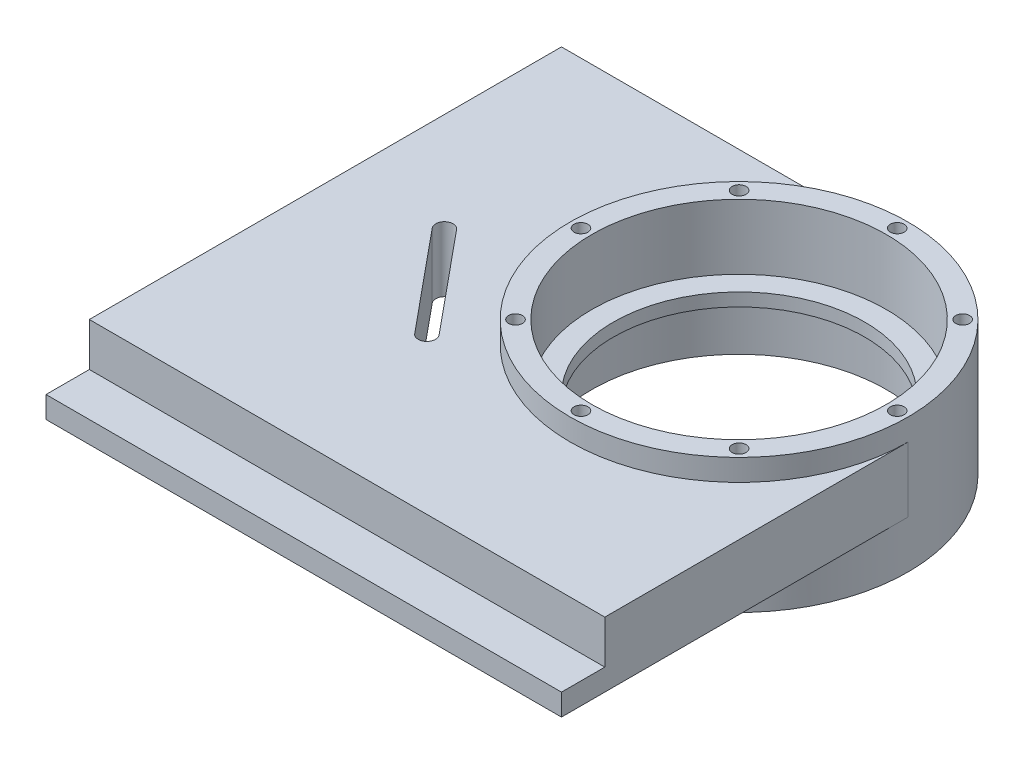
ISO-10303-21;
HEADER;
FILE_DESCRIPTION(('STEP AP214'),'2;1');
FILE_NAME('part.step','',(''),(''),'','','');
FILE_SCHEMA(('AUTOMOTIVE_DESIGN { 1 0 10303 214 1 1 1 1 }'));
ENDSEC;
DATA;
#1=APPLICATION_CONTEXT('core data for automotive mechanical design processes');
#2=APPLICATION_PROTOCOL_DEFINITION('international standard','automotive_design',2000,#1);
#3=PRODUCT_CONTEXT('',#1,'mechanical');
#4=PRODUCT('Part','Part','',(#3));
#5=PRODUCT_RELATED_PRODUCT_CATEGORY('part','',(#4));
#6=PRODUCT_DEFINITION_FORMATION('','',#4);
#7=PRODUCT_DEFINITION_CONTEXT('part definition',#1,'design');
#8=PRODUCT_DEFINITION('design','',#6,#7);
#9=PRODUCT_DEFINITION_SHAPE('','',#8);
#10=(LENGTH_UNIT() NAMED_UNIT(*) SI_UNIT(.MILLI.,.METRE.));
#11=(NAMED_UNIT(*) PLANE_ANGLE_UNIT() SI_UNIT($,.RADIAN.));
#12=(NAMED_UNIT(*) SI_UNIT($,.STERADIAN.) SOLID_ANGLE_UNIT());
#13=UNCERTAINTY_MEASURE_WITH_UNIT(LENGTH_MEASURE(1.E-05),#10,'distance_accuracy_value','');
#14=(GEOMETRIC_REPRESENTATION_CONTEXT(3) GLOBAL_UNCERTAINTY_ASSIGNED_CONTEXT((#13)) GLOBAL_UNIT_ASSIGNED_CONTEXT((#10,
#11,#12)) REPRESENTATION_CONTEXT('',''));
#15=CARTESIAN_POINT('',(0.,0.,0.));
#16=DIRECTION('',(0.,0.,1.));
#17=DIRECTION('',(1.,0.,0.));
#18=AXIS2_PLACEMENT_3D('',#15,#16,#17);
#19=CARTESIAN_POINT('',(0.,-5.,80.));
#20=DIRECTION('',(0.,0.,1.));
#21=DIRECTION('',(1.,0.,0.));
#22=AXIS2_PLACEMENT_3D('',#19,#20,#21);
#23=PLANE('',#22);
#24=DIRECTION('',(0.,1.,0.));
#25=VECTOR('',#24,1.);
#26=CARTESIAN_POINT('',(39.,-5.,80.));
#27=LINE('',#26,#25);
#28=CARTESIAN_POINT('',(39.,-5.,80.));
#29=VERTEX_POINT('',#28);
#30=CARTESIAN_POINT('',(39.,0.,80.));
#31=VERTEX_POINT('',#30);
#32=EDGE_CURVE('E254',#29,#31,#27,.T.);
#33=ORIENTED_EDGE('',*,*,#32,.T.);
#34=DIRECTION('',(1.,0.,0.));
#35=VECTOR('',#34,1.);
#36=CARTESIAN_POINT('',(-80.,0.,80.));
#37=LINE('',#36,#35);
#38=CARTESIAN_POINT('',(-80.,0.,80.));
#39=VERTEX_POINT('',#38);
#40=EDGE_CURVE('E210',#39,#31,#37,.T.);
#41=ORIENTED_EDGE('',*,*,#40,.F.);
#42=DIRECTION('',(0.,1.,0.));
#43=VECTOR('',#42,1.);
#44=CARTESIAN_POINT('',(-80.,-5.,80.));
#45=LINE('',#44,#43);
#46=CARTESIAN_POINT('',(-80.,-5.,80.));
#47=VERTEX_POINT('',#46);
#48=EDGE_CURVE('E257',#47,#39,#45,.T.);
#49=ORIENTED_EDGE('',*,*,#48,.F.);
#50=DIRECTION('',(1.,0.,0.));
#51=VECTOR('',#50,1.);
#52=CARTESIAN_POINT('',(0.,-5.,80.));
#53=LINE('',#52,#51);
#54=EDGE_CURVE('E244',#47,#29,#53,.T.);
#55=ORIENTED_EDGE('',*,*,#54,.T.);
#56=EDGE_LOOP('',(#33,#41,#49,#55));
#57=FACE_BOUND('',#56,.T.);
#58=ADVANCED_FACE('F39',(#57),#23,.T.);
#59=CARTESIAN_POINT('',(0.,15.,0.));
#60=DIRECTION('',(0.,-1.,0.));
#61=DIRECTION('',(0.,0.,-1.));
#62=AXIS2_PLACEMENT_3D('',#59,#60,#61);
#63=CYLINDRICAL_SURFACE('',#62,39.);
#64=CARTESIAN_POINT('',(0.,-16.,0.));
#65=DIRECTION('',(0.,1.,0.));
#66=DIRECTION('',(0.,0.,1.));
#67=AXIS2_PLACEMENT_3D('',#64,#65,#66);
#68=CIRCLE('',#67,39.);
#69=CARTESIAN_POINT('',(0.,-16.,39.));
#70=VERTEX_POINT('',#69);
#71=EDGE_CURVE('E266',#70,#70,#68,.T.);
#72=ORIENTED_EDGE('',*,*,#71,.T.);
#73=EDGE_LOOP('',(#72));
#74=FACE_BOUND('',#73,.T.);
#75=CARTESIAN_POINT('',(0.,15.,0.));
#76=DIRECTION('',(0.,1.,0.));
#77=DIRECTION('',(0.,0.,1.));
#78=AXIS2_PLACEMENT_3D('',#75,#76,#77);
#79=CIRCLE('',#78,39.);
#80=CARTESIAN_POINT('',(0.,15.,39.));
#81=VERTEX_POINT('',#80);
#82=EDGE_CURVE('E47',#81,#81,#79,.T.);
#83=ORIENTED_EDGE('',*,*,#82,.F.);
#84=EDGE_LOOP('',(#83));
#85=FACE_BOUND('',#84,.T.);
#86=CARTESIAN_POINT('',(0.,-5.,0.));
#87=DIRECTION('',(0.,1.,0.));
#88=DIRECTION('',(0.,0.,1.));
#89=AXIS2_PLACEMENT_3D('',#86,#87,#88);
#90=CIRCLE('',#89,39.);
#91=CARTESIAN_POINT('',(0.,-5.,-39.));
#92=VERTEX_POINT('',#91);
#93=CARTESIAN_POINT('',(39.,-5.,0.));
#94=VERTEX_POINT('',#93);
#95=EDGE_CURVE('E235',#92,#94,#90,.T.);
#96=ORIENTED_EDGE('',*,*,#95,.F.);
#97=DIRECTION('',(0.,1.,0.));
#98=VECTOR('',#97,1.);
#99=CARTESIAN_POINT('',(0.,-5.,-39.));
#100=LINE('',#99,#98);
#101=CARTESIAN_POINT('',(0.,10.,-39.));
#102=VERTEX_POINT('',#101);
#103=EDGE_CURVE('E249',#92,#102,#100,.T.);
#104=ORIENTED_EDGE('',*,*,#103,.T.);
#105=CARTESIAN_POINT('',(0.,10.,0.));
#106=DIRECTION('',(0.,1.,0.));
#107=DIRECTION('',(0.,0.,1.));
#108=AXIS2_PLACEMENT_3D('',#105,#106,#107);
#109=CIRCLE('',#108,39.);
#110=CARTESIAN_POINT('',(39.,10.,0.));
#111=VERTEX_POINT('',#110);
#112=EDGE_CURVE('E222',#102,#111,#109,.T.);
#113=ORIENTED_EDGE('',*,*,#112,.T.);
#114=DIRECTION('',(0.,1.,0.));
#115=VECTOR('',#114,1.);
#116=CARTESIAN_POINT('',(39.,-5.,0.));
#117=LINE('',#116,#115);
#118=EDGE_CURVE('E250',#94,#111,#117,.T.);
#119=ORIENTED_EDGE('',*,*,#118,.F.);
#120=EDGE_LOOP('',(#96,#104,#113,#119));
#121=FACE_BOUND('',#120,.T.);
#122=ADVANCED_FACE('F295',(#74,#85,#121),#63,.T.);
#123=CARTESIAN_POINT('',(0.,-3.,0.));
#124=DIRECTION('',(0.,1.,0.));
#125=DIRECTION('',(0.,0.,1.));
#126=AXIS2_PLACEMENT_3D('',#123,#124,#125);
#127=PLANE('',#126);
#128=CARTESIAN_POINT('',(0.,-3.,0.));
#129=DIRECTION('',(0.,1.,0.));
#130=DIRECTION('',(0.,0.,1.));
#131=AXIS2_PLACEMENT_3D('',#128,#129,#130);
#132=CIRCLE('',#131,29.);
#133=CARTESIAN_POINT('',(0.,-3.,29.));
#134=VERTEX_POINT('',#133);
#135=EDGE_CURVE('E270',#134,#134,#132,.T.);
#136=ORIENTED_EDGE('',*,*,#135,.T.);
#137=EDGE_LOOP('',(#136));
#138=FACE_BOUND('',#137,.T.);
#139=CARTESIAN_POINT('',(0.,-3.,0.));
#140=DIRECTION('',(0.,1.,0.));
#141=DIRECTION('',(0.,0.,1.));
#142=AXIS2_PLACEMENT_3D('',#139,#140,#141);
#143=CIRCLE('',#142,34.);
#144=CARTESIAN_POINT('',(0.,-3.,34.));
#145=VERTEX_POINT('',#144);
#146=EDGE_CURVE('E11',#145,#145,#143,.T.);
#147=ORIENTED_EDGE('',*,*,#146,.F.);
#148=EDGE_LOOP('',(#147));
#149=FACE_BOUND('',#148,.T.);
#150=ADVANCED_FACE('F287',(#138,#149),#127,.F.);
#151=CARTESIAN_POINT('',(0.,15.,0.));
#152=DIRECTION('',(0.,-1.,0.));
#153=DIRECTION('',(0.,0.,-1.));
#154=AXIS2_PLACEMENT_3D('',#151,#152,#153);
#155=CYLINDRICAL_SURFACE('',#154,34.);
#156=CARTESIAN_POINT('',(0.,15.,0.));
#157=DIRECTION('',(0.,1.,0.));
#158=DIRECTION('',(0.,0.,1.));
#159=AXIS2_PLACEMENT_3D('',#156,#157,#158);
#160=CIRCLE('',#159,34.);
#161=CARTESIAN_POINT('',(0.,15.,34.));
#162=VERTEX_POINT('',#161);
#163=EDGE_CURVE('E276',#162,#162,#160,.T.);
#164=ORIENTED_EDGE('',*,*,#163,.T.);
#165=EDGE_LOOP('',(#164));
#166=FACE_BOUND('',#165,.T.);
#167=CARTESIAN_POINT('',(0.,0.,0.));
#168=DIRECTION('',(0.,1.,0.));
#169=DIRECTION('',(0.,0.,1.));
#170=AXIS2_PLACEMENT_3D('',#167,#168,#169);
#171=CIRCLE('',#170,34.);
#172=CARTESIAN_POINT('',(0.,0.,34.));
#173=VERTEX_POINT('',#172);
#174=EDGE_CURVE('E273',#173,#173,#171,.T.);
#175=ORIENTED_EDGE('',*,*,#174,.F.);
#176=EDGE_LOOP('',(#175));
#177=FACE_BOUND('',#176,.T.);
#178=ADVANCED_FACE('F41',(#166,#177),#155,.F.);
#179=CARTESIAN_POINT('',(0.,15.,0.));
#180=DIRECTION('',(0.,1.,0.));
#181=DIRECTION('',(0.,0.,1.));
#182=AXIS2_PLACEMENT_3D('',#179,#180,#181);
#183=PLANE('',#182);
#184=CARTESIAN_POINT('',(0.,15.,-36.5));
#185=DIRECTION('',(0.,1.,0.));
#186=DIRECTION('',(0.,0.,1.));
#187=AXIS2_PLACEMENT_3D('',#184,#185,#186);
#188=CIRCLE('',#187,1.6);
#189=CARTESIAN_POINT('',(0.,15.,-34.9));
#190=VERTEX_POINT('',#189);
#191=EDGE_CURVE('E164',#190,#190,#188,.T.);
#192=ORIENTED_EDGE('',*,*,#191,.F.);
#193=EDGE_LOOP('',(#192));
#194=FACE_BOUND('',#193,.T.);
#195=CARTESIAN_POINT('',(25.8093975133094,15.,-25.8093975133101));
#196=DIRECTION('',(0.,1.,0.));
#197=DIRECTION('',(0.,0.,1.));
#198=AXIS2_PLACEMENT_3D('',#195,#196,#197);
#199=CIRCLE('',#198,1.60000000000018);
#200=CARTESIAN_POINT('',(25.8093975133094,15.,-24.2093975133099));
#201=VERTEX_POINT('',#200);
#202=EDGE_CURVE('E170',#201,#201,#199,.T.);
#203=ORIENTED_EDGE('',*,*,#202,.F.);
#204=EDGE_LOOP('',(#203));
#205=FACE_BOUND('',#204,.T.);
#206=CARTESIAN_POINT('',(36.5000000000015,15.,-1.55161863049773E-12));
#207=DIRECTION('',(0.,1.,0.));
#208=DIRECTION('',(0.,0.,1.));
#209=AXIS2_PLACEMENT_3D('',#206,#207,#208);
#210=CIRCLE('',#209,1.60000000000115);
#211=CARTESIAN_POINT('',(36.5000000000015,15.,1.5999999999996));
#212=VERTEX_POINT('',#211);
#213=EDGE_CURVE('E176',#212,#212,#210,.T.);
#214=ORIENTED_EDGE('',*,*,#213,.F.);
#215=EDGE_LOOP('',(#214));
#216=FACE_BOUND('',#215,.T.);
#217=CARTESIAN_POINT('',(25.8093975133116,15.,25.8093975133079));
#218=DIRECTION('',(0.,1.,0.));
#219=DIRECTION('',(0.,0.,1.));
#220=AXIS2_PLACEMENT_3D('',#217,#218,#219);
#221=CIRCLE('',#220,1.60000000000239);
#222=CARTESIAN_POINT('',(25.8093975133116,15.,27.4093975133103));
#223=VERTEX_POINT('',#222);
#224=EDGE_CURVE('E182',#223,#223,#221,.T.);
#225=ORIENTED_EDGE('',*,*,#224,.F.);
#226=EDGE_LOOP('',(#225));
#227=FACE_BOUND('',#226,.T.);
#228=CARTESIAN_POINT('',(3.10323726099546E-12,15.,36.5));
#229=DIRECTION('',(0.,1.,0.));
#230=DIRECTION('',(0.,0.,1.));
#231=AXIS2_PLACEMENT_3D('',#228,#229,#230);
#232=CIRCLE('',#231,1.60000000000321);
#233=CARTESIAN_POINT('',(3.10323726099546E-12,15.,38.1000000000032));
#234=VERTEX_POINT('',#233);
#235=EDGE_CURVE('E188',#234,#234,#232,.T.);
#236=ORIENTED_EDGE('',*,*,#235,.F.);
#237=EDGE_LOOP('',(#236));
#238=FACE_BOUND('',#237,.T.);
#239=CARTESIAN_POINT('',(-25.8093975133063,15.,25.8093975133101));
#240=DIRECTION('',(0.,1.,0.));
#241=DIRECTION('',(0.,0.,1.));
#242=AXIS2_PLACEMENT_3D('',#239,#240,#241);
#243=CIRCLE('',#242,1.60000000000316);
#244=CARTESIAN_POINT('',(-25.8093975133063,15.,27.4093975133132));
#245=VERTEX_POINT('',#244);
#246=EDGE_CURVE('E194',#245,#245,#243,.T.);
#247=ORIENTED_EDGE('',*,*,#246,.F.);
#248=EDGE_LOOP('',(#247));
#249=FACE_BOUND('',#248,.T.);
#250=CARTESIAN_POINT('',(-36.4999999999985,15.,1.55608859131462E-12));
#251=DIRECTION('',(0.,1.,0.));
#252=DIRECTION('',(0.,0.,1.));
#253=AXIS2_PLACEMENT_3D('',#250,#251,#252);
#254=CIRCLE('',#253,1.60000000000231);
#255=CARTESIAN_POINT('',(-36.4999999999985,15.,1.60000000000386));
#256=VERTEX_POINT('',#255);
#257=EDGE_CURVE('E200',#256,#256,#254,.T.);
#258=ORIENTED_EDGE('',*,*,#257,.F.);
#259=EDGE_LOOP('',(#258));
#260=FACE_BOUND('',#259,.T.);
#261=CARTESIAN_POINT('',(-25.8093975133085,15.,-25.8093975133079));
#262=DIRECTION('',(0.,1.,0.));
#263=DIRECTION('',(0.,0.,1.));
#264=AXIS2_PLACEMENT_3D('',#261,#262,#263);
#265=CIRCLE('',#264,1.60000000000119);
#266=CARTESIAN_POINT('',(-25.8093975133085,15.,-24.2093975133067));
#267=VERTEX_POINT('',#266);
#268=EDGE_CURVE('E159',#267,#267,#265,.T.);
#269=ORIENTED_EDGE('',*,*,#268,.F.);
#270=EDGE_LOOP('',(#269));
#271=FACE_BOUND('',#270,.T.);
#272=ORIENTED_EDGE('',*,*,#163,.F.);
#273=EDGE_LOOP('',(#272));
#274=FACE_BOUND('',#273,.T.);
#275=ORIENTED_EDGE('',*,*,#82,.T.);
#276=EDGE_LOOP('',(#275));
#277=FACE_BOUND('',#276,.T.);
#278=ADVANCED_FACE('F286',(#194,#205,#216,#227,#238,#249,#260,#271,#274,#277),#183,.T.);
#279=CARTESIAN_POINT('',(0.,0.,0.));
#280=DIRECTION('',(0.,1.,0.));
#281=DIRECTION('',(0.,0.,1.));
#282=AXIS2_PLACEMENT_3D('',#279,#280,#281);
#283=PLANE('',#282);
#284=CARTESIAN_POINT('',(0.,0.,0.));
#285=DIRECTION('',(0.,1.,0.));
#286=DIRECTION('',(0.,0.,1.));
#287=AXIS2_PLACEMENT_3D('',#284,#285,#286);
#288=CIRCLE('',#287,29.);
#289=CARTESIAN_POINT('',(0.,0.,29.));
#290=VERTEX_POINT('',#289);
#291=EDGE_CURVE('E269',#290,#290,#288,.T.);
#292=ORIENTED_EDGE('',*,*,#291,.F.);
#293=EDGE_LOOP('',(#292));
#294=FACE_BOUND('',#293,.T.);
#295=ORIENTED_EDGE('',*,*,#174,.T.);
#296=EDGE_LOOP('',(#295));
#297=FACE_BOUND('',#296,.T.);
#298=ADVANCED_FACE('F283',(#294,#297),#283,.T.);
#299=CARTESIAN_POINT('',(0.,-3.,0.));
#300=DIRECTION('',(0.,1.,0.));
#301=DIRECTION('',(0.,0.,1.));
#302=AXIS2_PLACEMENT_3D('',#299,#300,#301);
#303=CYLINDRICAL_SURFACE('',#302,29.);
#304=ORIENTED_EDGE('',*,*,#135,.F.);
#305=EDGE_LOOP('',(#304));
#306=FACE_BOUND('',#305,.T.);
#307=ORIENTED_EDGE('',*,*,#291,.T.);
#308=EDGE_LOOP('',(#307));
#309=FACE_BOUND('',#308,.T.);
#310=ADVANCED_FACE('F324',(#306,#309),#303,.F.);
#311=CARTESIAN_POINT('',(0.,-16.,0.));
#312=DIRECTION('',(0.,1.,0.));
#313=DIRECTION('',(0.,0.,1.));
#314=AXIS2_PLACEMENT_3D('',#311,#312,#313);
#315=CYLINDRICAL_SURFACE('',#314,34.);
#316=CARTESIAN_POINT('',(0.,-16.,0.));
#317=DIRECTION('',(0.,1.,0.));
#318=DIRECTION('',(0.,0.,1.));
#319=AXIS2_PLACEMENT_3D('',#316,#317,#318);
#320=CIRCLE('',#319,34.);
#321=CARTESIAN_POINT('',(0.,-16.,34.));
#322=VERTEX_POINT('',#321);
#323=EDGE_CURVE('E253',#322,#322,#320,.T.);
#324=ORIENTED_EDGE('',*,*,#323,.F.);
#325=EDGE_LOOP('',(#324));
#326=FACE_BOUND('',#325,.T.);
#327=ORIENTED_EDGE('',*,*,#146,.T.);
#328=EDGE_LOOP('',(#327));
#329=FACE_BOUND('',#328,.T.);
#330=ADVANCED_FACE('F321',(#326,#329),#315,.F.);
#331=CARTESIAN_POINT('',(0.,-16.,0.));
#332=DIRECTION('',(0.,1.,0.));
#333=DIRECTION('',(0.,0.,1.));
#334=AXIS2_PLACEMENT_3D('',#331,#332,#333);
#335=PLANE('',#334);
#336=ORIENTED_EDGE('',*,*,#323,.T.);
#337=EDGE_LOOP('',(#336));
#338=FACE_BOUND('',#337,.T.);
#339=ORIENTED_EDGE('',*,*,#71,.F.);
#340=EDGE_LOOP('',(#339));
#341=FACE_BOUND('',#340,.T.);
#342=ADVANCED_FACE('F318',(#338,#341),#335,.F.);
#343=CARTESIAN_POINT('',(39.,-5.,0.));
#344=DIRECTION('',(-1.,0.,0.));
#345=DIRECTION('',(0.,0.,1.));
#346=AXIS2_PLACEMENT_3D('',#343,#344,#345);
#347=PLANE('',#346);
#348=DIRECTION('',(0.,0.,1.));
#349=VECTOR('',#348,1.);
#350=CARTESIAN_POINT('',(39.,10.,0.));
#351=LINE('',#350,#349);
#352=CARTESIAN_POINT('',(39.,10.,70.));
#353=VERTEX_POINT('',#352);
#354=EDGE_CURVE('E232',#111,#353,#351,.T.);
#355=ORIENTED_EDGE('',*,*,#354,.T.);
#356=DIRECTION('',(0.,1.,0.));
#357=VECTOR('',#356,1.);
#358=CARTESIAN_POINT('',(39.,0.,70.));
#359=LINE('',#358,#357);
#360=CARTESIAN_POINT('',(39.,0.,70.));
#361=VERTEX_POINT('',#360);
#362=EDGE_CURVE('E217',#361,#353,#359,.T.);
#363=ORIENTED_EDGE('',*,*,#362,.F.);
#364=DIRECTION('',(0.,0.,-1.));
#365=VECTOR('',#364,1.);
#366=CARTESIAN_POINT('',(39.,0.,70.));
#367=LINE('',#366,#365);
#368=EDGE_CURVE('E212',#31,#361,#367,.T.);
#369=ORIENTED_EDGE('',*,*,#368,.F.);
#370=ORIENTED_EDGE('',*,*,#32,.F.);
#371=DIRECTION('',(0.,0.,1.));
#372=VECTOR('',#371,1.);
#373=CARTESIAN_POINT('',(39.,-5.,0.));
#374=LINE('',#373,#372);
#375=EDGE_CURVE('E247',#94,#29,#374,.T.);
#376=ORIENTED_EDGE('',*,*,#375,.F.);
#377=ORIENTED_EDGE('',*,*,#118,.T.);
#378=EDGE_LOOP('',(#355,#363,#369,#370,#376,#377));
#379=FACE_BOUND('',#378,.T.);
#380=ADVANCED_FACE('F307',(#379),#347,.F.);
#381=CARTESIAN_POINT('',(-80.,-5.,0.));
#382=DIRECTION('',(-1.,0.,0.));
#383=DIRECTION('',(0.,0.,1.));
#384=AXIS2_PLACEMENT_3D('',#381,#382,#383);
#385=PLANE('',#384);
#386=DIRECTION('',(0.,1.,0.));
#387=VECTOR('',#386,1.);
#388=CARTESIAN_POINT('',(-80.,0.,70.));
#389=LINE('',#388,#387);
#390=CARTESIAN_POINT('',(-80.,0.,70.));
#391=VERTEX_POINT('',#390);
#392=CARTESIAN_POINT('',(-80.,10.,70.));
#393=VERTEX_POINT('',#392);
#394=EDGE_CURVE('E219',#391,#393,#389,.T.);
#395=ORIENTED_EDGE('',*,*,#394,.T.);
#396=DIRECTION('',(0.,0.,1.));
#397=VECTOR('',#396,1.);
#398=CARTESIAN_POINT('',(-80.,10.,0.));
#399=LINE('',#398,#397);
#400=CARTESIAN_POINT('',(-80.,10.,-39.));
#401=VERTEX_POINT('',#400);
#402=EDGE_CURVE('E229',#401,#393,#399,.T.);
#403=ORIENTED_EDGE('',*,*,#402,.F.);
#404=DIRECTION('',(0.,1.,0.));
#405=VECTOR('',#404,1.);
#406=CARTESIAN_POINT('',(-80.,-5.,-39.));
#407=LINE('',#406,#405);
#408=CARTESIAN_POINT('',(-80.,-5.,-39.));
#409=VERTEX_POINT('',#408);
#410=EDGE_CURVE('E260',#409,#401,#407,.T.);
#411=ORIENTED_EDGE('',*,*,#410,.F.);
#412=DIRECTION('',(0.,0.,1.));
#413=VECTOR('',#412,1.);
#414=CARTESIAN_POINT('',(-80.,-5.,0.));
#415=LINE('',#414,#413);
#416=EDGE_CURVE('E241',#409,#47,#415,.T.);
#417=ORIENTED_EDGE('',*,*,#416,.T.);
#418=ORIENTED_EDGE('',*,*,#48,.T.);
#419=DIRECTION('',(0.,0.,1.));
#420=VECTOR('',#419,1.);
#421=CARTESIAN_POINT('',(-80.,0.,70.));
#422=LINE('',#421,#420);
#423=EDGE_CURVE('E208',#391,#39,#422,.T.);
#424=ORIENTED_EDGE('',*,*,#423,.F.);
#425=EDGE_LOOP('',(#395,#403,#411,#417,#418,#424));
#426=FACE_BOUND('',#425,.T.);
#427=ADVANCED_FACE('F309',(#426),#385,.T.);
#428=CARTESIAN_POINT('',(0.,-5.,-39.));
#429=DIRECTION('',(0.,0.,-1.));
#430=DIRECTION('',(-1.,0.,0.));
#431=AXIS2_PLACEMENT_3D('',#428,#429,#430);
#432=PLANE('',#431);
#433=ORIENTED_EDGE('',*,*,#410,.T.);
#434=DIRECTION('',(-1.,0.,0.));
#435=VECTOR('',#434,1.);
#436=CARTESIAN_POINT('',(0.,10.,-39.));
#437=LINE('',#436,#435);
#438=EDGE_CURVE('E226',#102,#401,#437,.T.);
#439=ORIENTED_EDGE('',*,*,#438,.F.);
#440=ORIENTED_EDGE('',*,*,#103,.F.);
#441=DIRECTION('',(-1.,0.,0.));
#442=VECTOR('',#441,1.);
#443=CARTESIAN_POINT('',(0.,-5.,-39.));
#444=LINE('',#443,#442);
#445=EDGE_CURVE('E238',#92,#409,#444,.T.);
#446=ORIENTED_EDGE('',*,*,#445,.T.);
#447=EDGE_LOOP('',(#433,#439,#440,#446));
#448=FACE_BOUND('',#447,.T.);
#449=ADVANCED_FACE('F312',(#448),#432,.T.);
#450=CARTESIAN_POINT('',(0.,-5.,0.));
#451=DIRECTION('',(0.,1.,0.));
#452=DIRECTION('',(0.,0.,1.));
#453=AXIS2_PLACEMENT_3D('',#450,#451,#452);
#454=PLANE('',#453);
#455=DIRECTION('',(-0.636511244597402,0.,-0.771267421521917));
#456=VECTOR('',#455,1.);
#457=CARTESIAN_POINT('',(-37.7937016630456,-5.,31.1903697890142));
#458=LINE('',#457,#456);
#459=CARTESIAN_POINT('',(-36.513231213203,-5.,32.7419294049165));
#460=VERTEX_POINT('',#459);
#461=CARTESIAN_POINT('',(-55.6085685511251,-5.,9.60390675925904));
#462=VERTEX_POINT('',#461);
#463=EDGE_CURVE('E153',#460,#462,#458,.T.);
#464=ORIENTED_EDGE('',*,*,#463,.T.);
#465=CARTESIAN_POINT('',(-57.151103394169,-5.,10.8769292484538));
#466=DIRECTION('',(0.,1.,0.));
#467=DIRECTION('',(0.,0.,1.));
#468=AXIS2_PLACEMENT_3D('',#465,#466,#467);
#469=CIRCLE('',#468,2.);
#470=CARTESIAN_POINT('',(-58.6936382372128,-5.,12.1499517376487));
#471=VERTEX_POINT('',#470);
#472=EDGE_CURVE('E156',#462,#471,#469,.T.);
#473=ORIENTED_EDGE('',*,*,#472,.T.);
#474=DIRECTION('',(0.636511244597403,0.,0.771267421521917));
#475=VECTOR('',#474,1.);
#476=CARTESIAN_POINT('',(-40.8787713491332,-5.,33.7364147674038));
#477=LINE('',#476,#475);
#478=CARTESIAN_POINT('',(-39.5983008992907,-5.,35.2879743833061));
#479=VERTEX_POINT('',#478);
#480=EDGE_CURVE('E148',#471,#479,#477,.T.);
#481=ORIENTED_EDGE('',*,*,#480,.T.);
#482=CARTESIAN_POINT('',(-38.0557660562469,-5.,34.0149518941113));
#483=DIRECTION('',(0.,1.,0.));
#484=DIRECTION('',(0.,0.,1.));
#485=AXIS2_PLACEMENT_3D('',#482,#483,#484);
#486=CIRCLE('',#485,2.);
#487=EDGE_CURVE('E128',#479,#460,#486,.T.);
#488=ORIENTED_EDGE('',*,*,#487,.T.);
#489=EDGE_LOOP('',(#464,#473,#481,#488));
#490=FACE_BOUND('',#489,.T.);
#491=ORIENTED_EDGE('',*,*,#95,.T.);
#492=ORIENTED_EDGE('',*,*,#375,.T.);
#493=ORIENTED_EDGE('',*,*,#54,.F.);
#494=ORIENTED_EDGE('',*,*,#416,.F.);
#495=ORIENTED_EDGE('',*,*,#445,.F.);
#496=EDGE_LOOP('',(#491,#492,#493,#494,#495));
#497=FACE_BOUND('',#496,.T.);
#498=ADVANCED_FACE('F316',(#490,#497),#454,.F.);
#499=CARTESIAN_POINT('',(0.,10.,0.));
#500=DIRECTION('',(0.,1.,0.));
#501=DIRECTION('',(0.,0.,1.));
#502=AXIS2_PLACEMENT_3D('',#499,#500,#501);
#503=PLANE('',#502);
#504=CARTESIAN_POINT('',(-57.151103394169,10.,10.8769292484538));
#505=DIRECTION('',(0.,1.,0.));
#506=DIRECTION('',(0.,0.,1.));
#507=AXIS2_PLACEMENT_3D('',#504,#505,#506);
#508=CIRCLE('',#507,2.);
#509=CARTESIAN_POINT('',(-55.6085685511251,10.,9.60390675925904));
#510=VERTEX_POINT('',#509);
#511=CARTESIAN_POINT('',(-58.6936382372128,10.,12.1499517376487));
#512=VERTEX_POINT('',#511);
#513=EDGE_CURVE('E62',#510,#512,#508,.T.);
#514=ORIENTED_EDGE('',*,*,#513,.F.);
#515=DIRECTION('',(-0.636511244597402,0.,-0.771267421521917));
#516=VECTOR('',#515,1.);
#517=CARTESIAN_POINT('',(-55.6085685511251,10.,9.60390675925904));
#518=LINE('',#517,#516);
#519=CARTESIAN_POINT('',(-36.513231213203,10.,32.7419294049165));
#520=VERTEX_POINT('',#519);
#521=EDGE_CURVE('E141',#520,#510,#518,.T.);
#522=ORIENTED_EDGE('',*,*,#521,.F.);
#523=CARTESIAN_POINT('',(-38.0557660562469,10.,34.0149518941113));
#524=DIRECTION('',(0.,1.,0.));
#525=DIRECTION('',(0.,0.,1.));
#526=AXIS2_PLACEMENT_3D('',#523,#524,#525);
#527=CIRCLE('',#526,2.);
#528=CARTESIAN_POINT('',(-39.5983008992907,10.,35.2879743833061));
#529=VERTEX_POINT('',#528);
#530=EDGE_CURVE('E125',#529,#520,#527,.T.);
#531=ORIENTED_EDGE('',*,*,#530,.F.);
#532=DIRECTION('',(0.636511244597403,0.,0.771267421521916));
#533=VECTOR('',#532,1.);
#534=CARTESIAN_POINT('',(-58.6936382372128,10.,12.1499517376487));
#535=LINE('',#534,#533);
#536=EDGE_CURVE('E134',#512,#529,#535,.T.);
#537=ORIENTED_EDGE('',*,*,#536,.F.);
#538=EDGE_LOOP('',(#514,#522,#531,#537));
#539=FACE_BOUND('',#538,.T.);
#540=DIRECTION('',(-1.,0.,0.));
#541=VECTOR('',#540,1.);
#542=CARTESIAN_POINT('',(-80.,10.,70.));
#543=LINE('',#542,#541);
#544=EDGE_CURVE('E163',#353,#393,#543,.T.);
#545=ORIENTED_EDGE('',*,*,#544,.F.);
#546=ORIENTED_EDGE('',*,*,#354,.F.);
#547=ORIENTED_EDGE('',*,*,#112,.F.);
#548=ORIENTED_EDGE('',*,*,#438,.T.);
#549=ORIENTED_EDGE('',*,*,#402,.T.);
#550=EDGE_LOOP('',(#545,#546,#547,#548,#549));
#551=FACE_BOUND('',#550,.T.);
#552=ADVANCED_FACE('F138',(#539,#551),#503,.T.);
#553=CARTESIAN_POINT('',(-80.,0.,70.));
#554=DIRECTION('',(0.,0.,-1.));
#555=DIRECTION('',(-1.,0.,0.));
#556=AXIS2_PLACEMENT_3D('',#553,#554,#555);
#557=PLANE('',#556);
#558=ORIENTED_EDGE('',*,*,#544,.T.);
#559=ORIENTED_EDGE('',*,*,#394,.F.);
#560=DIRECTION('',(-1.,0.,0.));
#561=VECTOR('',#560,1.);
#562=CARTESIAN_POINT('',(-80.,0.,70.));
#563=LINE('',#562,#561);
#564=EDGE_CURVE('E214',#361,#391,#563,.T.);
#565=ORIENTED_EDGE('',*,*,#564,.F.);
#566=ORIENTED_EDGE('',*,*,#362,.T.);
#567=EDGE_LOOP('',(#558,#559,#565,#566));
#568=FACE_BOUND('',#567,.T.);
#569=ADVANCED_FACE('F380',(#568),#557,.F.);
#570=CARTESIAN_POINT('',(0.,0.,0.));
#571=DIRECTION('',(0.,1.,0.));
#572=DIRECTION('',(0.,0.,1.));
#573=AXIS2_PLACEMENT_3D('',#570,#571,#572);
#574=PLANE('',#573);
#575=ORIENTED_EDGE('',*,*,#423,.T.);
#576=ORIENTED_EDGE('',*,*,#40,.T.);
#577=ORIENTED_EDGE('',*,*,#368,.T.);
#578=ORIENTED_EDGE('',*,*,#564,.T.);
#579=EDGE_LOOP('',(#575,#576,#577,#578));
#580=FACE_BOUND('',#579,.T.);
#581=ADVANCED_FACE('F387',(#580),#574,.T.);
#582=CARTESIAN_POINT('',(-25.8093975133085,8.,-25.8093975133079));
#583=DIRECTION('',(0.,1.,0.));
#584=DIRECTION('',(0.,0.,1.));
#585=AXIS2_PLACEMENT_3D('',#582,#583,#584);
#586=CYLINDRICAL_SURFACE('',#585,1.60000000000119);
#587=CARTESIAN_POINT('',(-25.8093975133085,8.,-25.8093975133079));
#588=DIRECTION('',(0.,1.,0.));
#589=DIRECTION('',(0.,0.,1.));
#590=AXIS2_PLACEMENT_3D('',#587,#588,#589);
#591=CIRCLE('',#590,1.60000000000119);
#592=CARTESIAN_POINT('',(-25.8093975133085,8.,-24.2093975133067));
#593=VERTEX_POINT('',#592);
#594=EDGE_CURVE('E203',#593,#593,#591,.T.);
#595=ORIENTED_EDGE('',*,*,#594,.F.);
#596=EDGE_LOOP('',(#595));
#597=FACE_BOUND('',#596,.T.);
#598=ORIENTED_EDGE('',*,*,#268,.T.);
#599=EDGE_LOOP('',(#598));
#600=FACE_BOUND('',#599,.T.);
#601=ADVANCED_FACE('F395',(#597,#600),#586,.F.);
#602=CARTESIAN_POINT('',(-25.8093975133085,8.,-25.8093975133079));
#603=DIRECTION('',(0.,1.,0.));
#604=DIRECTION('',(0.,0.,1.));
#605=AXIS2_PLACEMENT_3D('',#602,#603,#604);
#606=PLANE('',#605);
#607=ORIENTED_EDGE('',*,*,#594,.T.);
#608=EDGE_LOOP('',(#607));
#609=FACE_BOUND('',#608,.T.);
#610=ADVANCED_FACE('F404',(#609),#606,.T.);
#611=CARTESIAN_POINT('',(-36.4999999999985,8.,1.55608859131462E-12));
#612=DIRECTION('',(0.,1.,0.));
#613=DIRECTION('',(0.,0.,1.));
#614=AXIS2_PLACEMENT_3D('',#611,#612,#613);
#615=CYLINDRICAL_SURFACE('',#614,1.60000000000231);
#616=CARTESIAN_POINT('',(-36.4999999999985,8.,1.55608859131462E-12));
#617=DIRECTION('',(0.,1.,0.));
#618=DIRECTION('',(0.,0.,1.));
#619=AXIS2_PLACEMENT_3D('',#616,#617,#618);
#620=CIRCLE('',#619,1.60000000000231);
#621=CARTESIAN_POINT('',(-36.4999999999985,8.,1.60000000000386));
#622=VERTEX_POINT('',#621);
#623=EDGE_CURVE('E197',#622,#622,#620,.T.);
#624=ORIENTED_EDGE('',*,*,#623,.F.);
#625=EDGE_LOOP('',(#624));
#626=FACE_BOUND('',#625,.T.);
#627=ORIENTED_EDGE('',*,*,#257,.T.);
#628=EDGE_LOOP('',(#627));
#629=FACE_BOUND('',#628,.T.);
#630=ADVANCED_FACE('F412',(#626,#629),#615,.F.);
#631=CARTESIAN_POINT('',(-36.4999999999985,8.,1.55608859131462E-12));
#632=DIRECTION('',(0.,1.,0.));
#633=DIRECTION('',(0.,0.,1.));
#634=AXIS2_PLACEMENT_3D('',#631,#632,#633);
#635=PLANE('',#634);
#636=ORIENTED_EDGE('',*,*,#623,.T.);
#637=EDGE_LOOP('',(#636));
#638=FACE_BOUND('',#637,.T.);
#639=ADVANCED_FACE('F420',(#638),#635,.T.);
#640=CARTESIAN_POINT('',(-25.8093975133063,8.,25.8093975133101));
#641=DIRECTION('',(0.,1.,0.));
#642=DIRECTION('',(0.,0.,1.));
#643=AXIS2_PLACEMENT_3D('',#640,#641,#642);
#644=CYLINDRICAL_SURFACE('',#643,1.60000000000316);
#645=CARTESIAN_POINT('',(-25.8093975133063,8.,25.8093975133101));
#646=DIRECTION('',(0.,1.,0.));
#647=DIRECTION('',(0.,0.,1.));
#648=AXIS2_PLACEMENT_3D('',#645,#646,#647);
#649=CIRCLE('',#648,1.60000000000316);
#650=CARTESIAN_POINT('',(-25.8093975133063,8.,27.4093975133132));
#651=VERTEX_POINT('',#650);
#652=EDGE_CURVE('E191',#651,#651,#649,.T.);
#653=ORIENTED_EDGE('',*,*,#652,.F.);
#654=EDGE_LOOP('',(#653));
#655=FACE_BOUND('',#654,.T.);
#656=ORIENTED_EDGE('',*,*,#246,.T.);
#657=EDGE_LOOP('',(#656));
#658=FACE_BOUND('',#657,.T.);
#659=ADVANCED_FACE('F428',(#655,#658),#644,.F.);
#660=CARTESIAN_POINT('',(-25.8093975133063,8.,25.8093975133101));
#661=DIRECTION('',(0.,1.,0.));
#662=DIRECTION('',(0.,0.,1.));
#663=AXIS2_PLACEMENT_3D('',#660,#661,#662);
#664=PLANE('',#663);
#665=ORIENTED_EDGE('',*,*,#652,.T.);
#666=EDGE_LOOP('',(#665));
#667=FACE_BOUND('',#666,.T.);
#668=ADVANCED_FACE('F436',(#667),#664,.T.);
#669=CARTESIAN_POINT('',(3.10323726099546E-12,8.,36.5));
#670=DIRECTION('',(0.,1.,0.));
#671=DIRECTION('',(0.,0.,1.));
#672=AXIS2_PLACEMENT_3D('',#669,#670,#671);
#673=CYLINDRICAL_SURFACE('',#672,1.60000000000321);
#674=CARTESIAN_POINT('',(3.10323726099546E-12,8.,36.5));
#675=DIRECTION('',(0.,1.,0.));
#676=DIRECTION('',(0.,0.,1.));
#677=AXIS2_PLACEMENT_3D('',#674,#675,#676);
#678=CIRCLE('',#677,1.60000000000321);
#679=CARTESIAN_POINT('',(3.10323726099546E-12,8.,38.1000000000032));
#680=VERTEX_POINT('',#679);
#681=EDGE_CURVE('E185',#680,#680,#678,.T.);
#682=ORIENTED_EDGE('',*,*,#681,.F.);
#683=EDGE_LOOP('',(#682));
#684=FACE_BOUND('',#683,.T.);
#685=ORIENTED_EDGE('',*,*,#235,.T.);
#686=EDGE_LOOP('',(#685));
#687=FACE_BOUND('',#686,.T.);
#688=ADVANCED_FACE('F444',(#684,#687),#673,.F.);
#689=CARTESIAN_POINT('',(3.10323726099546E-12,8.,36.5));
#690=DIRECTION('',(0.,1.,0.));
#691=DIRECTION('',(0.,0.,1.));
#692=AXIS2_PLACEMENT_3D('',#689,#690,#691);
#693=PLANE('',#692);
#694=ORIENTED_EDGE('',*,*,#681,.T.);
#695=EDGE_LOOP('',(#694));
#696=FACE_BOUND('',#695,.T.);
#697=ADVANCED_FACE('F452',(#696),#693,.T.);
#698=CARTESIAN_POINT('',(25.8093975133116,8.,25.8093975133079));
#699=DIRECTION('',(0.,1.,0.));
#700=DIRECTION('',(0.,0.,1.));
#701=AXIS2_PLACEMENT_3D('',#698,#699,#700);
#702=CYLINDRICAL_SURFACE('',#701,1.60000000000239);
#703=CARTESIAN_POINT('',(25.8093975133116,8.,25.8093975133079));
#704=DIRECTION('',(0.,1.,0.));
#705=DIRECTION('',(0.,0.,1.));
#706=AXIS2_PLACEMENT_3D('',#703,#704,#705);
#707=CIRCLE('',#706,1.60000000000239);
#708=CARTESIAN_POINT('',(25.8093975133116,8.,27.4093975133103));
#709=VERTEX_POINT('',#708);
#710=EDGE_CURVE('E179',#709,#709,#707,.T.);
#711=ORIENTED_EDGE('',*,*,#710,.F.);
#712=EDGE_LOOP('',(#711));
#713=FACE_BOUND('',#712,.T.);
#714=ORIENTED_EDGE('',*,*,#224,.T.);
#715=EDGE_LOOP('',(#714));
#716=FACE_BOUND('',#715,.T.);
#717=ADVANCED_FACE('F460',(#713,#716),#702,.F.);
#718=CARTESIAN_POINT('',(25.8093975133116,8.,25.8093975133079));
#719=DIRECTION('',(0.,1.,0.));
#720=DIRECTION('',(0.,0.,1.));
#721=AXIS2_PLACEMENT_3D('',#718,#719,#720);
#722=PLANE('',#721);
#723=ORIENTED_EDGE('',*,*,#710,.T.);
#724=EDGE_LOOP('',(#723));
#725=FACE_BOUND('',#724,.T.);
#726=ADVANCED_FACE('F468',(#725),#722,.T.);
#727=CARTESIAN_POINT('',(36.5000000000015,8.,-1.55161863049773E-12));
#728=DIRECTION('',(0.,1.,0.));
#729=DIRECTION('',(0.,0.,1.));
#730=AXIS2_PLACEMENT_3D('',#727,#728,#729);
#731=CYLINDRICAL_SURFACE('',#730,1.60000000000115);
#732=CARTESIAN_POINT('',(36.5000000000015,8.,-1.55161863049773E-12));
#733=DIRECTION('',(0.,1.,0.));
#734=DIRECTION('',(0.,0.,1.));
#735=AXIS2_PLACEMENT_3D('',#732,#733,#734);
#736=CIRCLE('',#735,1.60000000000115);
#737=CARTESIAN_POINT('',(36.5000000000015,8.,1.5999999999996));
#738=VERTEX_POINT('',#737);
#739=EDGE_CURVE('E173',#738,#738,#736,.T.);
#740=ORIENTED_EDGE('',*,*,#739,.F.);
#741=EDGE_LOOP('',(#740));
#742=FACE_BOUND('',#741,.T.);
#743=ORIENTED_EDGE('',*,*,#213,.T.);
#744=EDGE_LOOP('',(#743));
#745=FACE_BOUND('',#744,.T.);
#746=ADVANCED_FACE('F476',(#742,#745),#731,.F.);
#747=CARTESIAN_POINT('',(36.5000000000015,8.,-1.55161863049773E-12));
#748=DIRECTION('',(0.,1.,0.));
#749=DIRECTION('',(0.,0.,1.));
#750=AXIS2_PLACEMENT_3D('',#747,#748,#749);
#751=PLANE('',#750);
#752=ORIENTED_EDGE('',*,*,#739,.T.);
#753=EDGE_LOOP('',(#752));
#754=FACE_BOUND('',#753,.T.);
#755=ADVANCED_FACE('F484',(#754),#751,.T.);
#756=CARTESIAN_POINT('',(25.8093975133094,8.,-25.8093975133101));
#757=DIRECTION('',(0.,1.,0.));
#758=DIRECTION('',(0.,0.,1.));
#759=AXIS2_PLACEMENT_3D('',#756,#757,#758);
#760=CYLINDRICAL_SURFACE('',#759,1.60000000000018);
#761=CARTESIAN_POINT('',(25.8093975133094,8.,-25.8093975133101));
#762=DIRECTION('',(0.,1.,0.));
#763=DIRECTION('',(0.,0.,1.));
#764=AXIS2_PLACEMENT_3D('',#761,#762,#763);
#765=CIRCLE('',#764,1.60000000000018);
#766=CARTESIAN_POINT('',(25.8093975133094,8.,-24.2093975133099));
#767=VERTEX_POINT('',#766);
#768=EDGE_CURVE('E167',#767,#767,#765,.T.);
#769=ORIENTED_EDGE('',*,*,#768,.F.);
#770=EDGE_LOOP('',(#769));
#771=FACE_BOUND('',#770,.T.);
#772=ORIENTED_EDGE('',*,*,#202,.T.);
#773=EDGE_LOOP('',(#772));
#774=FACE_BOUND('',#773,.T.);
#775=ADVANCED_FACE('F492',(#771,#774),#760,.F.);
#776=CARTESIAN_POINT('',(25.8093975133094,8.,-25.8093975133101));
#777=DIRECTION('',(0.,1.,0.));
#778=DIRECTION('',(0.,0.,1.));
#779=AXIS2_PLACEMENT_3D('',#776,#777,#778);
#780=PLANE('',#779);
#781=ORIENTED_EDGE('',*,*,#768,.T.);
#782=EDGE_LOOP('',(#781));
#783=FACE_BOUND('',#782,.T.);
#784=ADVANCED_FACE('F500',(#783),#780,.T.);
#785=CARTESIAN_POINT('',(0.,8.,-36.5));
#786=DIRECTION('',(0.,1.,0.));
#787=DIRECTION('',(0.,0.,1.));
#788=AXIS2_PLACEMENT_3D('',#785,#786,#787);
#789=CYLINDRICAL_SURFACE('',#788,1.6);
#790=CARTESIAN_POINT('',(0.,8.,-36.5));
#791=DIRECTION('',(0.,1.,0.));
#792=DIRECTION('',(0.,0.,1.));
#793=AXIS2_PLACEMENT_3D('',#790,#791,#792);
#794=CIRCLE('',#793,1.6);
#795=CARTESIAN_POINT('',(0.,8.,-34.9));
#796=VERTEX_POINT('',#795);
#797=EDGE_CURVE('E160',#796,#796,#794,.T.);
#798=ORIENTED_EDGE('',*,*,#797,.F.);
#799=EDGE_LOOP('',(#798));
#800=FACE_BOUND('',#799,.T.);
#801=ORIENTED_EDGE('',*,*,#191,.T.);
#802=EDGE_LOOP('',(#801));
#803=FACE_BOUND('',#802,.T.);
#804=ADVANCED_FACE('F508',(#800,#803),#789,.F.);
#805=CARTESIAN_POINT('',(0.,8.,-36.5));
#806=DIRECTION('',(0.,1.,0.));
#807=DIRECTION('',(0.,0.,1.));
#808=AXIS2_PLACEMENT_3D('',#805,#806,#807);
#809=PLANE('',#808);
#810=ORIENTED_EDGE('',*,*,#797,.T.);
#811=EDGE_LOOP('',(#810));
#812=FACE_BOUND('',#811,.T.);
#813=ADVANCED_FACE('F516',(#812),#809,.T.);
#814=CARTESIAN_POINT('',(-57.151103394169,-16.,10.8769292484538));
#815=DIRECTION('',(0.,1.,0.));
#816=DIRECTION('',(0.,0.,1.));
#817=AXIS2_PLACEMENT_3D('',#814,#815,#816);
#818=CYLINDRICAL_SURFACE('',#817,2.);
#819=DIRECTION('',(0.,1.,0.));
#820=VECTOR('',#819,1.);
#821=CARTESIAN_POINT('',(-55.6085685511251,-16.,9.60390675925904));
#822=LINE('',#821,#820);
#823=EDGE_CURVE('E146',#462,#510,#822,.T.);
#824=ORIENTED_EDGE('',*,*,#823,.T.);
#825=ORIENTED_EDGE('',*,*,#513,.T.);
#826=DIRECTION('',(0.,1.,0.));
#827=VECTOR('',#826,1.);
#828=CARTESIAN_POINT('',(-58.6936382372128,-16.,12.1499517376487));
#829=LINE('',#828,#827);
#830=EDGE_CURVE('E131',#471,#512,#829,.T.);
#831=ORIENTED_EDGE('',*,*,#830,.F.);
#832=ORIENTED_EDGE('',*,*,#472,.F.);
#833=EDGE_LOOP('',(#824,#825,#831,#832));
#834=FACE_BOUND('',#833,.T.);
#835=ADVANCED_FACE('F523',(#834),#818,.F.);
#836=CARTESIAN_POINT('',(-55.6085685511251,-16.,9.60390675925904));
#837=DIRECTION('',(0.771267421521917,0.,-0.636511244597402));
#838=DIRECTION('',(-0.636511244597402,0.,-0.771267421521917));
#839=AXIS2_PLACEMENT_3D('',#836,#837,#838);
#840=PLANE('',#839);
#841=DIRECTION('',(0.,1.,0.));
#842=VECTOR('',#841,1.);
#843=CARTESIAN_POINT('',(-36.513231213203,-16.,32.7419294049165));
#844=LINE('',#843,#842);
#845=EDGE_CURVE('E130',#460,#520,#844,.T.);
#846=ORIENTED_EDGE('',*,*,#845,.T.);
#847=ORIENTED_EDGE('',*,*,#521,.T.);
#848=ORIENTED_EDGE('',*,*,#823,.F.);
#849=ORIENTED_EDGE('',*,*,#463,.F.);
#850=EDGE_LOOP('',(#846,#847,#848,#849));
#851=FACE_BOUND('',#850,.T.);
#852=ADVANCED_FACE('F530',(#851),#840,.F.);
#853=CARTESIAN_POINT('',(-38.0557660562469,-16.,34.0149518941113));
#854=DIRECTION('',(0.,1.,0.));
#855=DIRECTION('',(0.,0.,1.));
#856=AXIS2_PLACEMENT_3D('',#853,#854,#855);
#857=CYLINDRICAL_SURFACE('',#856,2.);
#858=DIRECTION('',(0.,1.,0.));
#859=VECTOR('',#858,1.);
#860=CARTESIAN_POINT('',(-39.5983008992907,-16.,35.2879743833061));
#861=LINE('',#860,#859);
#862=EDGE_CURVE('E54',#479,#529,#861,.T.);
#863=ORIENTED_EDGE('',*,*,#862,.T.);
#864=ORIENTED_EDGE('',*,*,#530,.T.);
#865=ORIENTED_EDGE('',*,*,#845,.F.);
#866=ORIENTED_EDGE('',*,*,#487,.F.);
#867=EDGE_LOOP('',(#863,#864,#865,#866));
#868=FACE_BOUND('',#867,.T.);
#869=ADVANCED_FACE('F122',(#868),#857,.F.);
#870=CARTESIAN_POINT('',(-58.6936382372128,-16.,12.1499517376487));
#871=DIRECTION('',(-0.771267421521916,0.,0.636511244597403));
#872=DIRECTION('',(0.636511244597403,0.,0.771267421521917));
#873=AXIS2_PLACEMENT_3D('',#870,#871,#872);
#874=PLANE('',#873);
#875=ORIENTED_EDGE('',*,*,#830,.T.);
#876=ORIENTED_EDGE('',*,*,#536,.T.);
#877=ORIENTED_EDGE('',*,*,#862,.F.);
#878=ORIENTED_EDGE('',*,*,#480,.F.);
#879=EDGE_LOOP('',(#875,#876,#877,#878));
#880=FACE_BOUND('',#879,.T.);
#881=ADVANCED_FACE('F135',(#880),#874,.F.);
#882=CLOSED_SHELL('',(#58,#122,#150,#178,#278,#298,#310,#330,#342,#380,#427,#449,#498,#552,#569,
#581,#601,#610,#630,#639,#659,#668,#688,#697,#717,#726,#746,#755,#775,#784,#804,#813,#835,#852,
#869,#881));
#883=MANIFOLD_SOLID_BREP('B2',#882);
#884=ADVANCED_BREP_SHAPE_REPRESENTATION('',(#18,#883),#14);
#885=SHAPE_DEFINITION_REPRESENTATION(#9,#884);
ENDSEC;
END-ISO-10303-21;
